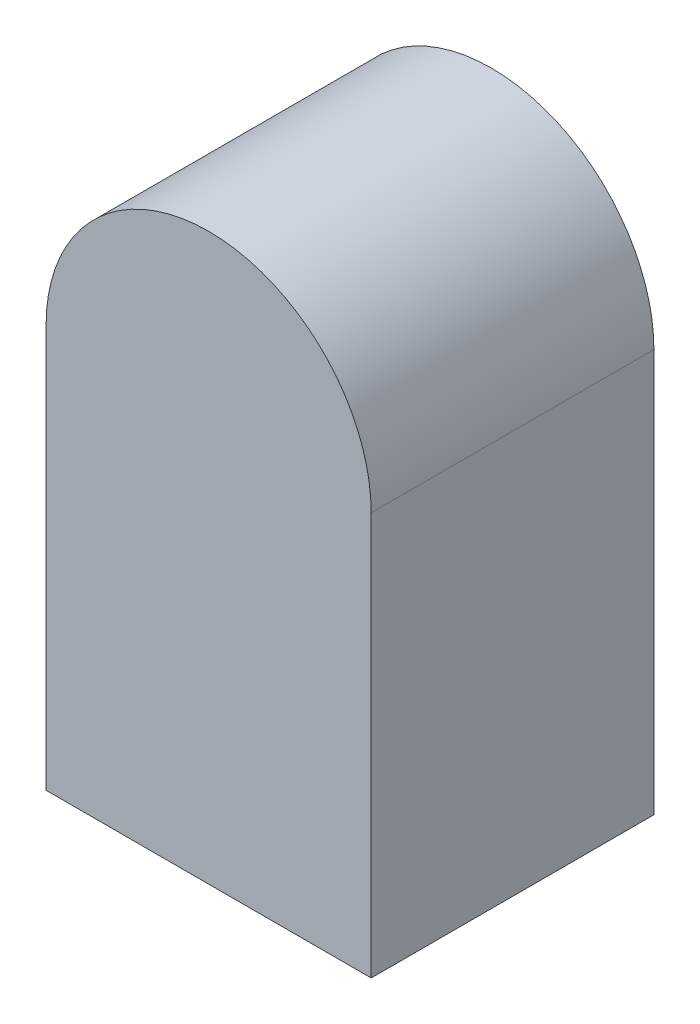
ISO-10303-21;
HEADER;
FILE_DESCRIPTION(('STEP AP214'),'2;1');
FILE_NAME('part.step','',(''),(''),'','','');
FILE_SCHEMA(('AUTOMOTIVE_DESIGN { 1 0 10303 214 1 1 1 1 }'));
ENDSEC;
DATA;
#1=APPLICATION_CONTEXT('core data for automotive mechanical design processes');
#2=APPLICATION_PROTOCOL_DEFINITION('international standard','automotive_design',2000,#1);
#3=PRODUCT_CONTEXT('',#1,'mechanical');
#4=PRODUCT('Part','Part','',(#3));
#5=PRODUCT_RELATED_PRODUCT_CATEGORY('part','',(#4));
#6=PRODUCT_DEFINITION_FORMATION('','',#4);
#7=PRODUCT_DEFINITION_CONTEXT('part definition',#1,'design');
#8=PRODUCT_DEFINITION('design','',#6,#7);
#9=PRODUCT_DEFINITION_SHAPE('','',#8);
#10=(LENGTH_UNIT() NAMED_UNIT(*) SI_UNIT(.MILLI.,.METRE.));
#11=(NAMED_UNIT(*) PLANE_ANGLE_UNIT() SI_UNIT($,.RADIAN.));
#12=(NAMED_UNIT(*) SI_UNIT($,.STERADIAN.) SOLID_ANGLE_UNIT());
#13=UNCERTAINTY_MEASURE_WITH_UNIT(LENGTH_MEASURE(1.E-05),#10,'distance_accuracy_value','');
#14=(GEOMETRIC_REPRESENTATION_CONTEXT(3) GLOBAL_UNCERTAINTY_ASSIGNED_CONTEXT((#13)) GLOBAL_UNIT_ASSIGNED_CONTEXT((#10,
#11,#12)) REPRESENTATION_CONTEXT('',''));
#15=CARTESIAN_POINT('',(0.,0.,0.));
#16=DIRECTION('',(0.,0.,1.));
#17=DIRECTION('',(1.,0.,0.));
#18=AXIS2_PLACEMENT_3D('',#15,#16,#17);
#19=CARTESIAN_POINT('',(-0.750000000000001,-2.8335240809167,0.2));
#20=DIRECTION('',(0.,0.,1.));
#21=DIRECTION('',(1.,0.,0.));
#22=AXIS2_PLACEMENT_3D('',#19,#20,#21);
#23=PLANE('',#22);
#24=DIRECTION('',(0.,-1.,0.));
#25=VECTOR('',#24,1.);
#26=CARTESIAN_POINT('',(-0.865,-2.715,0.2));
#27=LINE('',#26,#25);
#28=CARTESIAN_POINT('',(-0.865,-2.715,0.2));
#29=VERTEX_POINT('',#28);
#30=CARTESIAN_POINT('',(-0.865000000000001,-3.,0.2));
#31=VERTEX_POINT('',#30);
#32=EDGE_CURVE('E11',#29,#31,#27,.T.);
#33=ORIENTED_EDGE('',*,*,#32,.T.);
#34=DIRECTION('',(1.,0.,0.));
#35=VECTOR('',#34,1.);
#36=CARTESIAN_POINT('',(-1.875,-3.,0.2));
#37=LINE('',#36,#35);
#38=CARTESIAN_POINT('',(-0.635000000000001,-3.,0.2));
#39=VERTEX_POINT('',#38);
#40=EDGE_CURVE('E24',#31,#39,#37,.T.);
#41=ORIENTED_EDGE('',*,*,#40,.T.);
#42=DIRECTION('',(0.,1.,0.));
#43=VECTOR('',#42,1.);
#44=CARTESIAN_POINT('',(-0.635000000000001,-3.,0.2));
#45=LINE('',#44,#43);
#46=CARTESIAN_POINT('',(-0.635000000000001,-2.715,0.2));
#47=VERTEX_POINT('',#46);
#48=EDGE_CURVE('E88',#39,#47,#45,.T.);
#49=ORIENTED_EDGE('',*,*,#48,.T.);
#50=CARTESIAN_POINT('',(-0.75,-2.715,0.2));
#51=DIRECTION('',(0.,0.,1.));
#52=DIRECTION('',(1.,0.,0.));
#53=AXIS2_PLACEMENT_3D('',#50,#51,#52);
#54=CIRCLE('',#53,0.115);
#55=EDGE_CURVE('E70',#47,#29,#54,.T.);
#56=ORIENTED_EDGE('',*,*,#55,.T.);
#57=EDGE_LOOP('',(#33,#41,#49,#56));
#58=FACE_BOUND('',#57,.T.);
#59=ADVANCED_FACE('F17',(#58),#23,.T.);
#60=CARTESIAN_POINT('',(-3.,-3.,0.));
#61=DIRECTION('',(0.,-1.,0.));
#62=DIRECTION('',(1.,0.,0.));
#63=AXIS2_PLACEMENT_3D('',#60,#61,#62);
#64=PLANE('',#63);
#65=DIRECTION('',(0.,0.,-1.));
#66=VECTOR('',#65,1.);
#67=CARTESIAN_POINT('',(-0.635000000000001,-3.,0.));
#68=LINE('',#67,#66);
#69=CARTESIAN_POINT('',(-0.635000000000001,-3.,0.));
#70=VERTEX_POINT('',#69);
#71=EDGE_CURVE('E76',#39,#70,#68,.T.);
#72=ORIENTED_EDGE('',*,*,#71,.F.);
#73=ORIENTED_EDGE('',*,*,#40,.F.);
#74=DIRECTION('',(0.,0.,1.));
#75=VECTOR('',#74,1.);
#76=CARTESIAN_POINT('',(-0.865000000000001,-3.,0.));
#77=LINE('',#76,#75);
#78=CARTESIAN_POINT('',(-0.865000000000001,-3.,0.));
#79=VERTEX_POINT('',#78);
#80=EDGE_CURVE('E84',#79,#31,#77,.T.);
#81=ORIENTED_EDGE('',*,*,#80,.F.);
#82=DIRECTION('',(1.,0.,0.));
#83=VECTOR('',#82,1.);
#84=CARTESIAN_POINT('',(-0.865000000000001,-3.,0.));
#85=LINE('',#84,#83);
#86=EDGE_CURVE('E82',#79,#70,#85,.T.);
#87=ORIENTED_EDGE('',*,*,#86,.T.);
#88=EDGE_LOOP('',(#72,#73,#81,#87));
#89=FACE_BOUND('',#88,.T.);
#90=ADVANCED_FACE('F90',(#89),#64,.T.);
#91=CARTESIAN_POINT('',(-0.865,-2.715,0.));
#92=DIRECTION('',(-1.,0.,0.));
#93=DIRECTION('',(0.,-1.,0.));
#94=AXIS2_PLACEMENT_3D('',#91,#92,#93);
#95=PLANE('',#94);
#96=DIRECTION('',(0.,-1.,0.));
#97=VECTOR('',#96,1.);
#98=CARTESIAN_POINT('',(-0.865,-2.715,0.));
#99=LINE('',#98,#97);
#100=CARTESIAN_POINT('',(-0.865,-2.715,0.));
#101=VERTEX_POINT('',#100);
#102=EDGE_CURVE('E61',#101,#79,#99,.T.);
#103=ORIENTED_EDGE('',*,*,#102,.T.);
#104=ORIENTED_EDGE('',*,*,#80,.T.);
#105=ORIENTED_EDGE('',*,*,#32,.F.);
#106=DIRECTION('',(0.,0.,1.));
#107=VECTOR('',#106,1.);
#108=CARTESIAN_POINT('',(-0.865,-2.715,0.));
#109=LINE('',#108,#107);
#110=EDGE_CURVE('E64',#101,#29,#109,.T.);
#111=ORIENTED_EDGE('',*,*,#110,.F.);
#112=EDGE_LOOP('',(#103,#104,#105,#111));
#113=FACE_BOUND('',#112,.T.);
#114=ADVANCED_FACE('F91',(#113),#95,.T.);
#115=CARTESIAN_POINT('',(-0.75,-2.715,0.));
#116=DIRECTION('',(0.,0.,1.));
#117=DIRECTION('',(1.,0.,0.));
#118=AXIS2_PLACEMENT_3D('',#115,#116,#117);
#119=CYLINDRICAL_SURFACE('',#118,0.115);
#120=CARTESIAN_POINT('',(-0.75,-2.715,0.));
#121=DIRECTION('',(0.,0.,1.));
#122=DIRECTION('',(1.,0.,0.));
#123=AXIS2_PLACEMENT_3D('',#120,#121,#122);
#124=CIRCLE('',#123,0.115);
#125=CARTESIAN_POINT('',(-0.635000000000001,-2.715,0.));
#126=VERTEX_POINT('',#125);
#127=EDGE_CURVE('E54',#126,#101,#124,.T.);
#128=ORIENTED_EDGE('',*,*,#127,.T.);
#129=ORIENTED_EDGE('',*,*,#110,.T.);
#130=ORIENTED_EDGE('',*,*,#55,.F.);
#131=DIRECTION('',(0.,0.,1.));
#132=VECTOR('',#131,1.);
#133=CARTESIAN_POINT('',(-0.635000000000001,-2.715,0.));
#134=LINE('',#133,#132);
#135=EDGE_CURVE('E65',#126,#47,#134,.T.);
#136=ORIENTED_EDGE('',*,*,#135,.F.);
#137=EDGE_LOOP('',(#128,#129,#130,#136));
#138=FACE_BOUND('',#137,.T.);
#139=ADVANCED_FACE('F69',(#138),#119,.T.);
#140=CARTESIAN_POINT('',(-0.635000000000001,-3.,0.));
#141=DIRECTION('',(1.,0.,0.));
#142=DIRECTION('',(0.,1.,0.));
#143=AXIS2_PLACEMENT_3D('',#140,#141,#142);
#144=PLANE('',#143);
#145=DIRECTION('',(0.,1.,0.));
#146=VECTOR('',#145,1.);
#147=CARTESIAN_POINT('',(-0.635000000000001,-3.,0.));
#148=LINE('',#147,#146);
#149=EDGE_CURVE('E59',#70,#126,#148,.T.);
#150=ORIENTED_EDGE('',*,*,#149,.T.);
#151=ORIENTED_EDGE('',*,*,#135,.T.);
#152=ORIENTED_EDGE('',*,*,#48,.F.);
#153=ORIENTED_EDGE('',*,*,#71,.T.);
#154=EDGE_LOOP('',(#150,#151,#152,#153));
#155=FACE_BOUND('',#154,.T.);
#156=ADVANCED_FACE('F74',(#155),#144,.T.);
#157=CARTESIAN_POINT('',(-0.750000000000001,-2.8335265642716,0.));
#158=DIRECTION('',(0.,0.,1.));
#159=DIRECTION('',(0.,1.,0.));
#160=AXIS2_PLACEMENT_3D('',#157,#158,#159);
#161=PLANE('',#160);
#162=ORIENTED_EDGE('',*,*,#86,.F.);
#163=ORIENTED_EDGE('',*,*,#102,.F.);
#164=ORIENTED_EDGE('',*,*,#127,.F.);
#165=ORIENTED_EDGE('',*,*,#149,.F.);
#166=EDGE_LOOP('',(#162,#163,#164,#165));
#167=FACE_BOUND('',#166,.T.);
#168=ADVANCED_FACE('F57',(#167),#161,.F.);
#169=CLOSED_SHELL('',(#59,#90,#114,#139,#156,#168));
#170=MANIFOLD_SOLID_BREP('B1',#169);
#171=ADVANCED_BREP_SHAPE_REPRESENTATION('',(#18,#170),#14);
#172=SHAPE_DEFINITION_REPRESENTATION(#9,#171);
ENDSEC;
END-ISO-10303-21;
